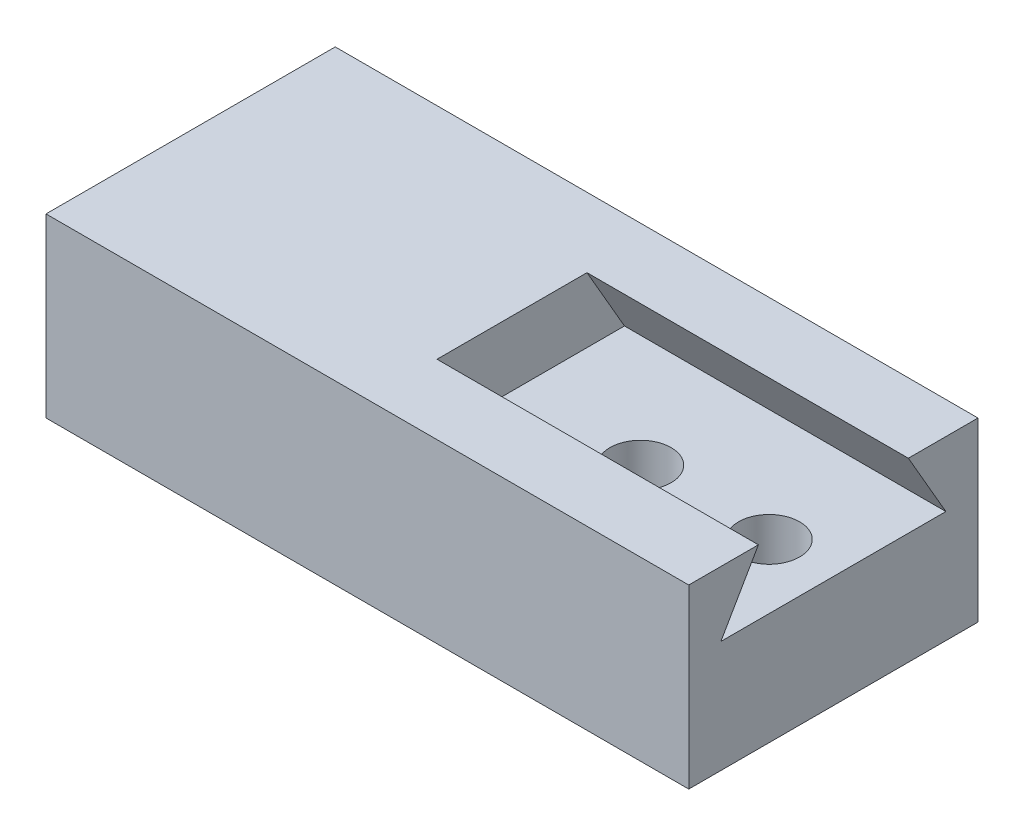
ISO-10303-21;
HEADER;
FILE_DESCRIPTION(('STEP AP214'),'2;1');
FILE_NAME('part.step','',(''),(''),'','','');
FILE_SCHEMA(('AUTOMOTIVE_DESIGN { 1 0 10303 214 1 1 1 1 }'));
ENDSEC;
DATA;
#1=APPLICATION_CONTEXT('core data for automotive mechanical design processes');
#2=APPLICATION_PROTOCOL_DEFINITION('international standard','automotive_design',2000,#1);
#3=PRODUCT_CONTEXT('',#1,'mechanical');
#4=PRODUCT('Part','Part','',(#3));
#5=PRODUCT_RELATED_PRODUCT_CATEGORY('part','',(#4));
#6=PRODUCT_DEFINITION_FORMATION('','',#4);
#7=PRODUCT_DEFINITION_CONTEXT('part definition',#1,'design');
#8=PRODUCT_DEFINITION('design','',#6,#7);
#9=PRODUCT_DEFINITION_SHAPE('','',#8);
#10=(LENGTH_UNIT() NAMED_UNIT(*) SI_UNIT(.MILLI.,.METRE.));
#11=(NAMED_UNIT(*) PLANE_ANGLE_UNIT() SI_UNIT($,.RADIAN.));
#12=(NAMED_UNIT(*) SI_UNIT($,.STERADIAN.) SOLID_ANGLE_UNIT());
#13=UNCERTAINTY_MEASURE_WITH_UNIT(LENGTH_MEASURE(1.E-05),#10,'distance_accuracy_value','');
#14=(GEOMETRIC_REPRESENTATION_CONTEXT(3) GLOBAL_UNCERTAINTY_ASSIGNED_CONTEXT((#13)) GLOBAL_UNIT_ASSIGNED_CONTEXT((#10,
#11,#12)) REPRESENTATION_CONTEXT('',''));
#15=CARTESIAN_POINT('',(0.,0.,0.));
#16=DIRECTION('',(0.,0.,1.));
#17=DIRECTION('',(1.,0.,0.));
#18=AXIS2_PLACEMENT_3D('',#15,#16,#17);
#19=CARTESIAN_POINT('',(5.,-2.75,0.));
#20=DIRECTION('',(0.,1.,0.));
#21=DIRECTION('',(0.,0.,1.));
#22=AXIS2_PLACEMENT_3D('',#19,#20,#21);
#23=PLANE('',#22);
#24=DIRECTION('',(-1.,0.,0.));
#25=VECTOR('',#24,1.);
#26=CARTESIAN_POINT('',(5.,-2.75,2.25));
#27=LINE('',#26,#25);
#28=CARTESIAN_POINT('',(5.,-2.75,2.25));
#29=VERTEX_POINT('',#28);
#30=CARTESIAN_POINT('',(-5.,-2.75,2.25));
#31=VERTEX_POINT('',#30);
#32=EDGE_CURVE('E107',#29,#31,#27,.T.);
#33=ORIENTED_EDGE('',*,*,#32,.T.);
#34=DIRECTION('',(0.,0.,-1.));
#35=VECTOR('',#34,1.);
#36=CARTESIAN_POINT('',(-5.,-2.75,2.25));
#37=LINE('',#36,#35);
#38=CARTESIAN_POINT('',(-5.,-2.75,-2.25));
#39=VERTEX_POINT('',#38);
#40=EDGE_CURVE('E141',#31,#39,#37,.T.);
#41=ORIENTED_EDGE('',*,*,#40,.T.);
#42=DIRECTION('',(-1.,0.,0.));
#43=VECTOR('',#42,1.);
#44=CARTESIAN_POINT('',(5.,-2.75,-2.25));
#45=LINE('',#44,#43);
#46=CARTESIAN_POINT('',(5.,-2.75,-2.25));
#47=VERTEX_POINT('',#46);
#48=EDGE_CURVE('E202',#47,#39,#45,.T.);
#49=ORIENTED_EDGE('',*,*,#48,.F.);
#50=DIRECTION('',(0.,0.,-1.));
#51=VECTOR('',#50,1.);
#52=CARTESIAN_POINT('',(5.,-2.75,0.));
#53=LINE('',#52,#51);
#54=EDGE_CURVE('E52',#29,#47,#53,.T.);
#55=ORIENTED_EDGE('',*,*,#54,.F.);
#56=EDGE_LOOP('',(#33,#41,#49,#55));
#57=FACE_BOUND('',#56,.T.);
#58=CARTESIAN_POINT('',(2.,-2.75,0.));
#59=DIRECTION('',(0.,-1.,0.));
#60=DIRECTION('',(0.,0.,-1.));
#61=AXIS2_PLACEMENT_3D('',#58,#59,#60);
#62=CIRCLE('',#61,0.475);
#63=CARTESIAN_POINT('',(2.,-2.75,-0.475));
#64=VERTEX_POINT('',#63);
#65=EDGE_CURVE('E150',#64,#64,#62,.T.);
#66=ORIENTED_EDGE('',*,*,#65,.F.);
#67=EDGE_LOOP('',(#66));
#68=FACE_BOUND('',#67,.T.);
#69=CARTESIAN_POINT('',(4.,-2.75,0.));
#70=DIRECTION('',(0.,-1.,0.));
#71=DIRECTION('',(0.,0.,-1.));
#72=AXIS2_PLACEMENT_3D('',#69,#70,#71);
#73=CIRCLE('',#72,0.475);
#74=CARTESIAN_POINT('',(4.,-2.75,-0.475));
#75=VERTEX_POINT('',#74);
#76=EDGE_CURVE('E156',#75,#75,#73,.T.);
#77=ORIENTED_EDGE('',*,*,#76,.F.);
#78=EDGE_LOOP('',(#77));
#79=FACE_BOUND('',#78,.T.);
#80=ADVANCED_FACE('F35',(#57,#68,#79),#23,.F.);
#81=CARTESIAN_POINT('',(5.,0.,-2.25));
#82=DIRECTION('',(0.,0.,-1.));
#83=DIRECTION('',(0.,1.,0.));
#84=AXIS2_PLACEMENT_3D('',#81,#82,#83);
#85=PLANE('',#84);
#86=ORIENTED_EDGE('',*,*,#48,.T.);
#87=DIRECTION('',(0.,-1.,0.));
#88=VECTOR('',#87,1.);
#89=CARTESIAN_POINT('',(-5.,0.,-2.25));
#90=LINE('',#89,#88);
#91=CARTESIAN_POINT('',(-5.,0.,-2.25));
#92=VERTEX_POINT('',#91);
#93=EDGE_CURVE('E144',#92,#39,#90,.T.);
#94=ORIENTED_EDGE('',*,*,#93,.F.);
#95=DIRECTION('',(-1.,0.,0.));
#96=VECTOR('',#95,1.);
#97=CARTESIAN_POINT('',(5.,0.,-2.25));
#98=LINE('',#97,#96);
#99=CARTESIAN_POINT('',(5.,0.,-2.25));
#100=VERTEX_POINT('',#99);
#101=EDGE_CURVE('E11',#100,#92,#98,.T.);
#102=ORIENTED_EDGE('',*,*,#101,.F.);
#103=DIRECTION('',(0.,-1.,0.));
#104=VECTOR('',#103,1.);
#105=CARTESIAN_POINT('',(5.,0.,-2.25));
#106=LINE('',#105,#104);
#107=EDGE_CURVE('E126',#100,#47,#106,.T.);
#108=ORIENTED_EDGE('',*,*,#107,.T.);
#109=EDGE_LOOP('',(#86,#94,#102,#108));
#110=FACE_BOUND('',#109,.T.);
#111=ADVANCED_FACE('F37',(#110),#85,.T.);
#112=CARTESIAN_POINT('',(5.,0.505181485540923,-0.875000000000004));
#113=DIRECTION('',(0.,-0.499999999999999,0.866025403784439));
#114=DIRECTION('',(0.,-0.86602540378444,-0.499999999999999));
#115=AXIS2_PLACEMENT_3D('',#112,#113,#114);
#116=PLANE('',#115);
#117=DIRECTION('',(0.,0.86602540378444,0.499999999999999));
#118=VECTOR('',#117,1.);
#119=CARTESIAN_POINT('',(0.,0.505181485540923,-0.875000000000004));
#120=LINE('',#119,#118);
#121=CARTESIAN_POINT('',(0.,-1.01036297108184,-1.75));
#122=VERTEX_POINT('',#121);
#123=CARTESIAN_POINT('',(0.,0.,-1.16666666666667));
#124=VERTEX_POINT('',#123);
#125=EDGE_CURVE('E140',#122,#124,#120,.T.);
#126=ORIENTED_EDGE('',*,*,#125,.F.);
#127=DIRECTION('',(-1.,0.,0.));
#128=VECTOR('',#127,1.);
#129=CARTESIAN_POINT('',(5.,-1.01036297108184,-1.75));
#130=LINE('',#129,#128);
#131=CARTESIAN_POINT('',(5.,-1.01036297108184,-1.75));
#132=VERTEX_POINT('',#131);
#133=EDGE_CURVE('E192',#132,#122,#130,.T.);
#134=ORIENTED_EDGE('',*,*,#133,.F.);
#135=DIRECTION('',(0.,0.86602540378444,0.499999999999999));
#136=VECTOR('',#135,1.);
#137=CARTESIAN_POINT('',(5.,0.505181485540923,-0.875000000000004));
#138=LINE('',#137,#136);
#139=CARTESIAN_POINT('',(5.,0.,-1.16666666666667));
#140=VERTEX_POINT('',#139);
#141=EDGE_CURVE('E125',#132,#140,#138,.T.);
#142=ORIENTED_EDGE('',*,*,#141,.T.);
#143=DIRECTION('',(-1.,0.,0.));
#144=VECTOR('',#143,1.);
#145=CARTESIAN_POINT('',(5.,0.,-1.16666666666667));
#146=LINE('',#145,#144);
#147=EDGE_CURVE('E44',#140,#124,#146,.T.);
#148=ORIENTED_EDGE('',*,*,#147,.T.);
#149=EDGE_LOOP('',(#126,#134,#142,#148));
#150=FACE_BOUND('',#149,.T.);
#151=ADVANCED_FACE('F169',(#150),#116,.T.);
#152=CARTESIAN_POINT('',(5.,-1.01036297108184,0.));
#153=DIRECTION('',(0.,1.,0.));
#154=DIRECTION('',(0.,0.,1.));
#155=AXIS2_PLACEMENT_3D('',#152,#153,#154);
#156=PLANE('',#155);
#157=CARTESIAN_POINT('',(4.,-1.01036297108184,0.));
#158=DIRECTION('',(0.,1.,0.));
#159=DIRECTION('',(0.,0.,1.));
#160=AXIS2_PLACEMENT_3D('',#157,#158,#159);
#161=CIRCLE('',#160,0.475);
#162=CARTESIAN_POINT('',(4.,-1.01036297108184,0.475));
#163=VERTEX_POINT('',#162);
#164=EDGE_CURVE('E153',#163,#163,#161,.T.);
#165=ORIENTED_EDGE('',*,*,#164,.F.);
#166=EDGE_LOOP('',(#165));
#167=FACE_BOUND('',#166,.T.);
#168=CARTESIAN_POINT('',(2.,-1.01036297108184,0.));
#169=DIRECTION('',(0.,1.,0.));
#170=DIRECTION('',(0.,0.,1.));
#171=AXIS2_PLACEMENT_3D('',#168,#169,#170);
#172=CIRCLE('',#171,0.475);
#173=CARTESIAN_POINT('',(2.,-1.01036297108184,0.475));
#174=VERTEX_POINT('',#173);
#175=EDGE_CURVE('E137',#174,#174,#172,.T.);
#176=ORIENTED_EDGE('',*,*,#175,.F.);
#177=EDGE_LOOP('',(#176));
#178=FACE_BOUND('',#177,.T.);
#179=DIRECTION('',(0.,0.,-1.));
#180=VECTOR('',#179,1.);
#181=CARTESIAN_POINT('',(0.,-1.01036297108184,0.));
#182=LINE('',#181,#180);
#183=CARTESIAN_POINT('',(0.,-1.01036297108184,1.74999999999999));
#184=VERTEX_POINT('',#183);
#185=EDGE_CURVE('E132',#184,#122,#182,.T.);
#186=ORIENTED_EDGE('',*,*,#185,.F.);
#187=DIRECTION('',(-1.,0.,0.));
#188=VECTOR('',#187,1.);
#189=CARTESIAN_POINT('',(5.,-1.01036297108184,1.74999999999999));
#190=LINE('',#189,#188);
#191=CARTESIAN_POINT('',(5.,-1.01036297108184,1.74999999999999));
#192=VERTEX_POINT('',#191);
#193=EDGE_CURVE('E67',#192,#184,#190,.T.);
#194=ORIENTED_EDGE('',*,*,#193,.F.);
#195=DIRECTION('',(0.,0.,-1.));
#196=VECTOR('',#195,1.);
#197=CARTESIAN_POINT('',(5.,-1.01036297108184,0.));
#198=LINE('',#197,#196);
#199=EDGE_CURVE('E120',#192,#132,#198,.T.);
#200=ORIENTED_EDGE('',*,*,#199,.T.);
#201=ORIENTED_EDGE('',*,*,#133,.T.);
#202=EDGE_LOOP('',(#186,#194,#200,#201));
#203=FACE_BOUND('',#202,.T.);
#204=ADVANCED_FACE('F181',(#167,#178,#203),#156,.T.);
#205=CARTESIAN_POINT('',(5.,0.50518148554092,0.875000000000003));
#206=DIRECTION('',(0.,-0.499999999999997,-0.86602540378444));
#207=DIRECTION('',(0.,0.86602540378444,-0.499999999999997));
#208=AXIS2_PLACEMENT_3D('',#205,#206,#207);
#209=PLANE('',#208);
#210=DIRECTION('',(0.,-0.86602540378444,0.499999999999997));
#211=VECTOR('',#210,1.);
#212=CARTESIAN_POINT('',(0.,0.50518148554092,0.875000000000003));
#213=LINE('',#212,#211);
#214=CARTESIAN_POINT('',(0.,0.,1.16666666666667));
#215=VERTEX_POINT('',#214);
#216=EDGE_CURVE('E129',#215,#184,#213,.T.);
#217=ORIENTED_EDGE('',*,*,#216,.F.);
#218=DIRECTION('',(-1.,0.,0.));
#219=VECTOR('',#218,1.);
#220=CARTESIAN_POINT('',(5.,0.,1.16666666666667));
#221=LINE('',#220,#219);
#222=CARTESIAN_POINT('',(5.,0.,1.16666666666667));
#223=VERTEX_POINT('',#222);
#224=EDGE_CURVE('E75',#223,#215,#221,.T.);
#225=ORIENTED_EDGE('',*,*,#224,.F.);
#226=DIRECTION('',(0.,-0.86602540378444,0.499999999999997));
#227=VECTOR('',#226,1.);
#228=CARTESIAN_POINT('',(5.,0.50518148554092,0.875000000000003));
#229=LINE('',#228,#227);
#230=EDGE_CURVE('E117',#223,#192,#229,.T.);
#231=ORIENTED_EDGE('',*,*,#230,.T.);
#232=ORIENTED_EDGE('',*,*,#193,.T.);
#233=EDGE_LOOP('',(#217,#225,#231,#232));
#234=FACE_BOUND('',#233,.T.);
#235=ADVANCED_FACE('F178',(#234),#209,.T.);
#236=CARTESIAN_POINT('',(5.,0.,0.));
#237=DIRECTION('',(0.,1.,0.));
#238=DIRECTION('',(0.,0.,1.));
#239=AXIS2_PLACEMENT_3D('',#236,#237,#238);
#240=PLANE('',#239);
#241=ORIENTED_EDGE('',*,*,#224,.T.);
#242=DIRECTION('',(0.,0.,-1.));
#243=VECTOR('',#242,1.);
#244=CARTESIAN_POINT('',(0.,0.,2.25));
#245=LINE('',#244,#243);
#246=EDGE_CURVE('E135',#215,#124,#245,.T.);
#247=ORIENTED_EDGE('',*,*,#246,.T.);
#248=ORIENTED_EDGE('',*,*,#147,.F.);
#249=DIRECTION('',(0.,0.,-1.));
#250=VECTOR('',#249,1.);
#251=CARTESIAN_POINT('',(5.,0.,0.));
#252=LINE('',#251,#250);
#253=EDGE_CURVE('E119',#140,#100,#252,.T.);
#254=ORIENTED_EDGE('',*,*,#253,.T.);
#255=ORIENTED_EDGE('',*,*,#101,.T.);
#256=DIRECTION('',(0.,0.,-1.));
#257=VECTOR('',#256,1.);
#258=CARTESIAN_POINT('',(-5.,0.,2.25));
#259=LINE('',#258,#257);
#260=CARTESIAN_POINT('',(-5.,0.,2.25));
#261=VERTEX_POINT('',#260);
#262=EDGE_CURVE('E103',#261,#92,#259,.T.);
#263=ORIENTED_EDGE('',*,*,#262,.F.);
#264=DIRECTION('',(-1.,0.,0.));
#265=VECTOR('',#264,1.);
#266=CARTESIAN_POINT('',(5.,0.,2.25));
#267=LINE('',#266,#265);
#268=CARTESIAN_POINT('',(5.,0.,2.25));
#269=VERTEX_POINT('',#268);
#270=EDGE_CURVE('E96',#269,#261,#267,.T.);
#271=ORIENTED_EDGE('',*,*,#270,.F.);
#272=EDGE_CURVE('E100',#269,#223,#252,.T.);
#273=ORIENTED_EDGE('',*,*,#272,.T.);
#274=EDGE_LOOP('',(#241,#247,#248,#254,#255,#263,#271,#273));
#275=FACE_BOUND('',#274,.T.);
#276=ADVANCED_FACE('F98',(#275),#240,.T.);
#277=CARTESIAN_POINT('',(5.,0.,2.25));
#278=DIRECTION('',(0.,0.,-1.));
#279=DIRECTION('',(0.,1.,0.));
#280=AXIS2_PLACEMENT_3D('',#277,#278,#279);
#281=PLANE('',#280);
#282=ORIENTED_EDGE('',*,*,#270,.T.);
#283=DIRECTION('',(0.,-1.,0.));
#284=VECTOR('',#283,1.);
#285=CARTESIAN_POINT('',(-5.,0.,2.25));
#286=LINE('',#285,#284);
#287=EDGE_CURVE('E138',#261,#31,#286,.T.);
#288=ORIENTED_EDGE('',*,*,#287,.T.);
#289=ORIENTED_EDGE('',*,*,#32,.F.);
#290=DIRECTION('',(0.,-1.,0.));
#291=VECTOR('',#290,1.);
#292=CARTESIAN_POINT('',(5.,0.,2.25));
#293=LINE('',#292,#291);
#294=EDGE_CURVE('E110',#269,#29,#293,.T.);
#295=ORIENTED_EDGE('',*,*,#294,.F.);
#296=EDGE_LOOP('',(#282,#288,#289,#295));
#297=FACE_BOUND('',#296,.T.);
#298=ADVANCED_FACE('F111',(#297),#281,.F.);
#299=CARTESIAN_POINT('',(5.,0.,0.));
#300=DIRECTION('',(1.,0.,0.));
#301=DIRECTION('',(0.,0.,-1.));
#302=AXIS2_PLACEMENT_3D('',#299,#300,#301);
#303=PLANE('',#302);
#304=ORIENTED_EDGE('',*,*,#107,.F.);
#305=ORIENTED_EDGE('',*,*,#253,.F.);
#306=ORIENTED_EDGE('',*,*,#141,.F.);
#307=ORIENTED_EDGE('',*,*,#199,.F.);
#308=ORIENTED_EDGE('',*,*,#230,.F.);
#309=ORIENTED_EDGE('',*,*,#272,.F.);
#310=ORIENTED_EDGE('',*,*,#294,.T.);
#311=ORIENTED_EDGE('',*,*,#54,.T.);
#312=EDGE_LOOP('',(#304,#305,#306,#307,#308,#309,#310,#311));
#313=FACE_BOUND('',#312,.T.);
#314=ADVANCED_FACE('F115',(#313),#303,.T.);
#315=CARTESIAN_POINT('',(0.,0.,0.));
#316=DIRECTION('',(-1.,0.,0.));
#317=DIRECTION('',(0.,0.,1.));
#318=AXIS2_PLACEMENT_3D('',#315,#316,#317);
#319=PLANE('',#318);
#320=ORIENTED_EDGE('',*,*,#246,.F.);
#321=ORIENTED_EDGE('',*,*,#216,.T.);
#322=ORIENTED_EDGE('',*,*,#185,.T.);
#323=ORIENTED_EDGE('',*,*,#125,.T.);
#324=EDGE_LOOP('',(#320,#321,#322,#323));
#325=FACE_BOUND('',#324,.T.);
#326=ADVANCED_FACE('F197',(#325),#319,.F.);
#327=CARTESIAN_POINT('',(-5.,0.,0.));
#328=DIRECTION('',(-1.,0.,0.));
#329=DIRECTION('',(0.,0.,1.));
#330=AXIS2_PLACEMENT_3D('',#327,#328,#329);
#331=PLANE('',#330);
#332=ORIENTED_EDGE('',*,*,#262,.T.);
#333=ORIENTED_EDGE('',*,*,#93,.T.);
#334=ORIENTED_EDGE('',*,*,#40,.F.);
#335=ORIENTED_EDGE('',*,*,#287,.F.);
#336=EDGE_LOOP('',(#332,#333,#334,#335));
#337=FACE_BOUND('',#336,.T.);
#338=ADVANCED_FACE('F217',(#337),#331,.T.);
#339=CARTESIAN_POINT('',(2.,-2.75,0.));
#340=DIRECTION('',(0.,-1.,0.));
#341=DIRECTION('',(0.,0.,-1.));
#342=AXIS2_PLACEMENT_3D('',#339,#340,#341);
#343=CYLINDRICAL_SURFACE('',#342,0.475);
#344=ORIENTED_EDGE('',*,*,#65,.T.);
#345=EDGE_LOOP('',(#344));
#346=FACE_BOUND('',#345,.T.);
#347=ORIENTED_EDGE('',*,*,#175,.T.);
#348=EDGE_LOOP('',(#347));
#349=FACE_BOUND('',#348,.T.);
#350=ADVANCED_FACE('F219',(#346,#349),#343,.F.);
#351=CARTESIAN_POINT('',(4.,-2.75,0.));
#352=DIRECTION('',(0.,-1.,0.));
#353=DIRECTION('',(0.,0.,-1.));
#354=AXIS2_PLACEMENT_3D('',#351,#352,#353);
#355=CYLINDRICAL_SURFACE('',#354,0.475);
#356=ORIENTED_EDGE('',*,*,#76,.T.);
#357=EDGE_LOOP('',(#356));
#358=FACE_BOUND('',#357,.T.);
#359=ORIENTED_EDGE('',*,*,#164,.T.);
#360=EDGE_LOOP('',(#359));
#361=FACE_BOUND('',#360,.T.);
#362=ADVANCED_FACE('F160',(#358,#361),#355,.F.);
#363=CLOSED_SHELL('',(#80,#111,#151,#204,#235,#276,#298,#314,#326,#338,#350,#362));
#364=MANIFOLD_SOLID_BREP('B2',#363);
#365=ADVANCED_BREP_SHAPE_REPRESENTATION('',(#18,#364),#14);
#366=SHAPE_DEFINITION_REPRESENTATION(#9,#365);
ENDSEC;
END-ISO-10303-21;
